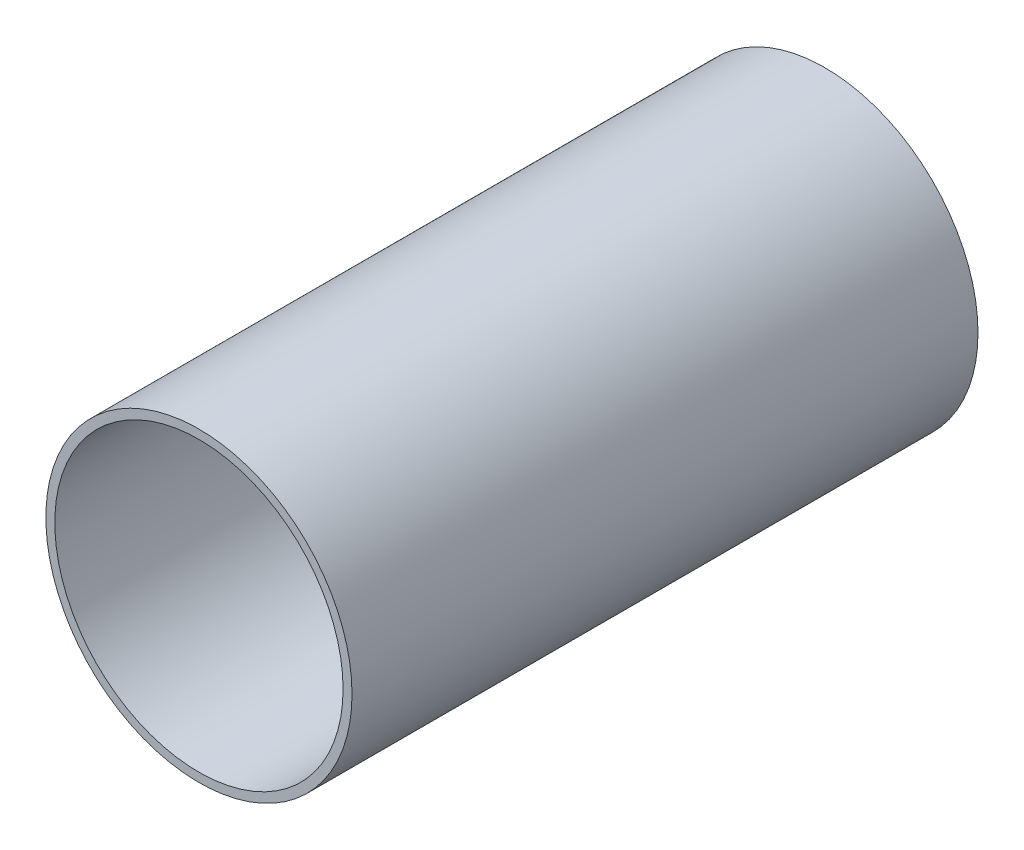
ISO-10303-21;
HEADER;
FILE_DESCRIPTION(('STEP AP214'),'2;1');
FILE_NAME('part.step','',(''),(''),'','','');
FILE_SCHEMA(('AUTOMOTIVE_DESIGN { 1 0 10303 214 1 1 1 1 }'));
ENDSEC;
DATA;
#1=APPLICATION_CONTEXT('core data for automotive mechanical design processes');
#2=APPLICATION_PROTOCOL_DEFINITION('international standard','automotive_design',2000,#1);
#3=PRODUCT_CONTEXT('',#1,'mechanical');
#4=PRODUCT('Part','Part','',(#3));
#5=PRODUCT_RELATED_PRODUCT_CATEGORY('part','',(#4));
#6=PRODUCT_DEFINITION_FORMATION('','',#4);
#7=PRODUCT_DEFINITION_CONTEXT('part definition',#1,'design');
#8=PRODUCT_DEFINITION('design','',#6,#7);
#9=PRODUCT_DEFINITION_SHAPE('','',#8);
#10=(LENGTH_UNIT() NAMED_UNIT(*) SI_UNIT(.MILLI.,.METRE.));
#11=(NAMED_UNIT(*) PLANE_ANGLE_UNIT() SI_UNIT($,.RADIAN.));
#12=(NAMED_UNIT(*) SI_UNIT($,.STERADIAN.) SOLID_ANGLE_UNIT());
#13=UNCERTAINTY_MEASURE_WITH_UNIT(LENGTH_MEASURE(1.E-05),#10,'distance_accuracy_value','');
#14=(GEOMETRIC_REPRESENTATION_CONTEXT(3) GLOBAL_UNCERTAINTY_ASSIGNED_CONTEXT((#13)) GLOBAL_UNIT_ASSIGNED_CONTEXT((#10,
#11,#12)) REPRESENTATION_CONTEXT('',''));
#15=CARTESIAN_POINT('',(0.,0.,0.));
#16=DIRECTION('',(0.,0.,1.));
#17=DIRECTION('',(1.,0.,0.));
#18=AXIS2_PLACEMENT_3D('',#15,#16,#17);
#19=CARTESIAN_POINT('',(12409.7404468767,3023.0315101292,700.));
#20=DIRECTION('',(0.,0.,1.));
#21=DIRECTION('',(1.,0.,0.));
#22=AXIS2_PLACEMENT_3D('',#19,#20,#21);
#23=PLANE('',#22);
#24=CARTESIAN_POINT('',(12409.7404468767,3023.0315101292,700.));
#25=DIRECTION('',(0.,0.,1.));
#26=DIRECTION('',(1.,0.,0.));
#27=AXIS2_PLACEMENT_3D('',#24,#25,#26);
#28=CIRCLE('',#27,171.186451307599);
#29=CARTESIAN_POINT('',(12580.9268981843,3023.0315101292,700.));
#30=VERTEX_POINT('',#29);
#31=EDGE_CURVE('E44',#30,#30,#28,.T.);
#32=ORIENTED_EDGE('',*,*,#31,.T.);
#33=EDGE_LOOP('',(#32));
#34=FACE_BOUND('',#33,.T.);
#35=CARTESIAN_POINT('',(12409.7404468767,3023.0315101292,700.));
#36=DIRECTION('',(0.,0.,1.));
#37=DIRECTION('',(1.,0.,0.));
#38=AXIS2_PLACEMENT_3D('',#35,#36,#37);
#39=CIRCLE('',#38,161.186451307599);
#40=CARTESIAN_POINT('',(12570.9268981843,3023.0315101292,700.));
#41=VERTEX_POINT('',#40);
#42=EDGE_CURVE('E53',#41,#41,#39,.T.);
#43=ORIENTED_EDGE('',*,*,#42,.F.);
#44=EDGE_LOOP('',(#43));
#45=FACE_BOUND('',#44,.T.);
#46=ADVANCED_FACE('F37',(#34,#45),#23,.T.);
#47=CARTESIAN_POINT('',(12409.7404468767,3023.0315101292,0.));
#48=DIRECTION('',(0.,0.,1.));
#49=DIRECTION('',(1.,0.,0.));
#50=AXIS2_PLACEMENT_3D('',#47,#48,#49);
#51=PLANE('',#50);
#52=CARTESIAN_POINT('',(12409.7404468767,3023.0315101292,0.));
#53=DIRECTION('',(0.,0.,1.));
#54=DIRECTION('',(1.,0.,0.));
#55=AXIS2_PLACEMENT_3D('',#52,#53,#54);
#56=CIRCLE('',#55,171.186451307599);
#57=CARTESIAN_POINT('',(12580.9268981843,3023.0315101292,0.));
#58=VERTEX_POINT('',#57);
#59=EDGE_CURVE('E48',#58,#58,#56,.T.);
#60=ORIENTED_EDGE('',*,*,#59,.F.);
#61=EDGE_LOOP('',(#60));
#62=FACE_BOUND('',#61,.T.);
#63=ADVANCED_FACE('F61',(#62),#51,.F.);
#64=CARTESIAN_POINT('',(12409.7404468767,3023.0315101292,700.));
#65=DIRECTION('',(0.,0.,-1.));
#66=DIRECTION('',(-1.,0.,0.));
#67=AXIS2_PLACEMENT_3D('',#64,#65,#66);
#68=CYLINDRICAL_SURFACE('',#67,171.186451307599);
#69=ORIENTED_EDGE('',*,*,#31,.F.);
#70=EDGE_LOOP('',(#69));
#71=FACE_BOUND('',#70,.T.);
#72=ORIENTED_EDGE('',*,*,#59,.T.);
#73=EDGE_LOOP('',(#72));
#74=FACE_BOUND('',#73,.T.);
#75=ADVANCED_FACE('F39',(#71,#74),#68,.T.);
#76=CARTESIAN_POINT('',(12409.7404468767,3023.0315101292,700.));
#77=DIRECTION('',(0.,0.,-1.));
#78=DIRECTION('',(-1.,0.,0.));
#79=AXIS2_PLACEMENT_3D('',#76,#77,#78);
#80=CYLINDRICAL_SURFACE('',#79,161.186451307599);
#81=CARTESIAN_POINT('',(12409.7404468767,3023.0315101292,10.));
#82=DIRECTION('',(0.,0.,1.));
#83=DIRECTION('',(1.,0.,0.));
#84=AXIS2_PLACEMENT_3D('',#81,#82,#83);
#85=CIRCLE('',#84,161.186451307599);
#86=CARTESIAN_POINT('',(12570.9268981843,3023.0315101292,10.));
#87=VERTEX_POINT('',#86);
#88=EDGE_CURVE('E11',#87,#87,#85,.T.);
#89=ORIENTED_EDGE('',*,*,#88,.F.);
#90=EDGE_LOOP('',(#89));
#91=FACE_BOUND('',#90,.T.);
#92=ORIENTED_EDGE('',*,*,#42,.T.);
#93=EDGE_LOOP('',(#92));
#94=FACE_BOUND('',#93,.T.);
#95=ADVANCED_FACE('F58',(#91,#94),#80,.F.);
#96=CARTESIAN_POINT('',(12409.7404468767,3023.0315101292,10.));
#97=DIRECTION('',(0.,0.,1.));
#98=DIRECTION('',(1.,0.,0.));
#99=AXIS2_PLACEMENT_3D('',#96,#97,#98);
#100=PLANE('',#99);
#101=ORIENTED_EDGE('',*,*,#88,.T.);
#102=EDGE_LOOP('',(#101));
#103=FACE_BOUND('',#102,.T.);
#104=ADVANCED_FACE('F70',(#103),#100,.T.);
#105=CLOSED_SHELL('',(#46,#63,#75,#95,#104));
#106=MANIFOLD_SOLID_BREP('B2',#105);
#107=ADVANCED_BREP_SHAPE_REPRESENTATION('',(#18,#106),#14);
#108=SHAPE_DEFINITION_REPRESENTATION(#9,#107);
ENDSEC;
END-ISO-10303-21;
